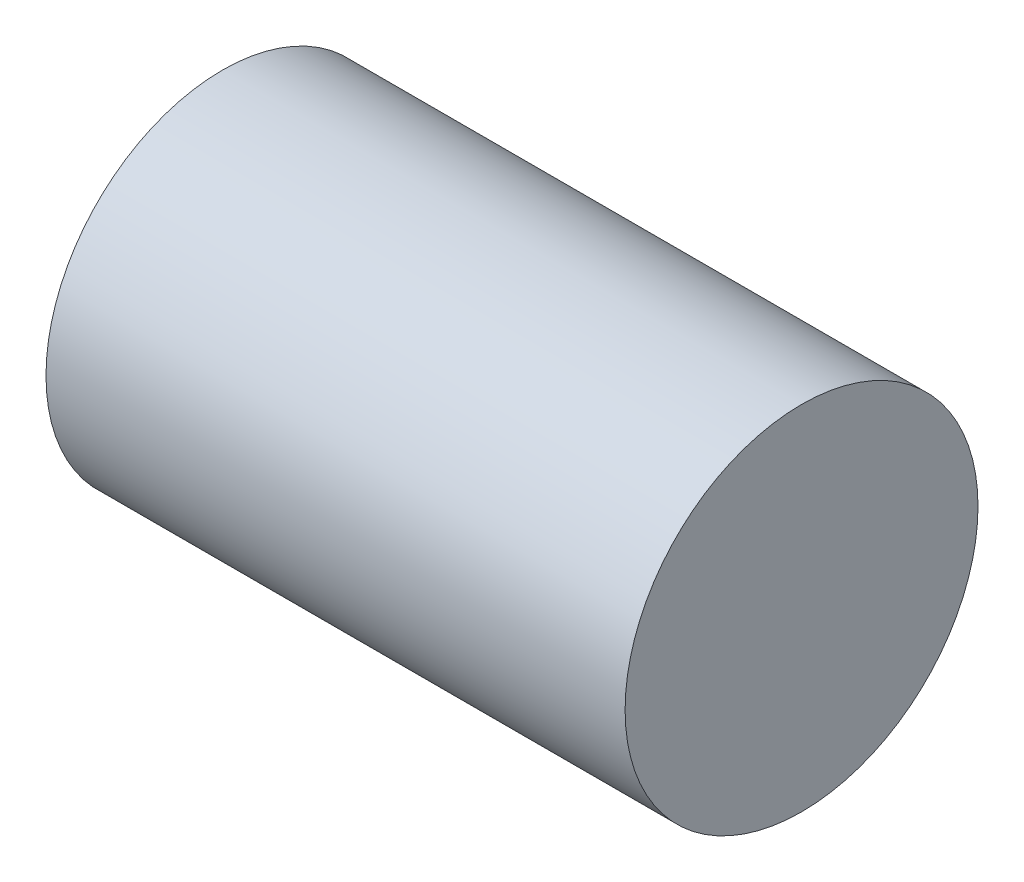
ISO-10303-21;
HEADER;
FILE_DESCRIPTION(('STEP AP214'),'2;1');
FILE_NAME('part.step','',(''),(''),'','','');
FILE_SCHEMA(('AUTOMOTIVE_DESIGN { 1 0 10303 214 1 1 1 1 }'));
ENDSEC;
DATA;
#1=APPLICATION_CONTEXT('core data for automotive mechanical design processes');
#2=APPLICATION_PROTOCOL_DEFINITION('international standard','automotive_design',2000,#1);
#3=PRODUCT_CONTEXT('',#1,'mechanical');
#4=PRODUCT('Part','Part','',(#3));
#5=PRODUCT_RELATED_PRODUCT_CATEGORY('part','',(#4));
#6=PRODUCT_DEFINITION_FORMATION('','',#4);
#7=PRODUCT_DEFINITION_CONTEXT('part definition',#1,'design');
#8=PRODUCT_DEFINITION('design','',#6,#7);
#9=PRODUCT_DEFINITION_SHAPE('','',#8);
#10=(LENGTH_UNIT() NAMED_UNIT(*) SI_UNIT(.MILLI.,.METRE.));
#11=(NAMED_UNIT(*) PLANE_ANGLE_UNIT() SI_UNIT($,.RADIAN.));
#12=(NAMED_UNIT(*) SI_UNIT($,.STERADIAN.) SOLID_ANGLE_UNIT());
#13=UNCERTAINTY_MEASURE_WITH_UNIT(LENGTH_MEASURE(1.E-05),#10,'distance_accuracy_value','');
#14=(GEOMETRIC_REPRESENTATION_CONTEXT(3) GLOBAL_UNCERTAINTY_ASSIGNED_CONTEXT((#13)) GLOBAL_UNIT_ASSIGNED_CONTEXT((#10,
#11,#12)) REPRESENTATION_CONTEXT('',''));
#15=CARTESIAN_POINT('',(0.,0.,0.));
#16=DIRECTION('',(0.,0.,1.));
#17=DIRECTION('',(1.,0.,0.));
#18=AXIS2_PLACEMENT_3D('',#15,#16,#17);
#19=CARTESIAN_POINT('',(64.,0.,0.));
#20=DIRECTION('',(-1.,0.,0.));
#21=DIRECTION('',(0.,0.,1.));
#22=AXIS2_PLACEMENT_3D('',#19,#20,#21);
#23=CYLINDRICAL_SURFACE('',#22,19.5);
#24=CARTESIAN_POINT('',(64.,0.,0.));
#25=DIRECTION('',(1.,0.,0.));
#26=DIRECTION('',(0.,0.,-1.));
#27=AXIS2_PLACEMENT_3D('',#24,#25,#26);
#28=CIRCLE('',#27,19.5);
#29=CARTESIAN_POINT('',(64.,0.,-19.5));
#30=VERTEX_POINT('',#29);
#31=EDGE_CURVE('E10',#30,#30,#28,.T.);
#32=ORIENTED_EDGE('',*,*,#31,.F.);
#33=EDGE_LOOP('',(#32));
#34=FACE_BOUND('',#33,.T.);
#35=CARTESIAN_POINT('',(0.,0.,0.));
#36=DIRECTION('',(1.,0.,0.));
#37=DIRECTION('',(0.,0.,-1.));
#38=AXIS2_PLACEMENT_3D('',#35,#36,#37);
#39=CIRCLE('',#38,19.5);
#40=CARTESIAN_POINT('',(0.,0.,-19.5));
#41=VERTEX_POINT('',#40);
#42=EDGE_CURVE('E34',#41,#41,#39,.T.);
#43=ORIENTED_EDGE('',*,*,#42,.T.);
#44=EDGE_LOOP('',(#43));
#45=FACE_BOUND('',#44,.T.);
#46=ADVANCED_FACE('F31',(#34,#45),#23,.T.);
#47=CARTESIAN_POINT('',(64.,0.,0.));
#48=DIRECTION('',(1.,0.,0.));
#49=DIRECTION('',(0.,0.,-1.));
#50=AXIS2_PLACEMENT_3D('',#47,#48,#49);
#51=PLANE('',#50);
#52=ORIENTED_EDGE('',*,*,#31,.T.);
#53=EDGE_LOOP('',(#52));
#54=FACE_BOUND('',#53,.T.);
#55=ADVANCED_FACE('F60',(#54),#51,.T.);
#56=CARTESIAN_POINT('',(0.,0.,0.));
#57=DIRECTION('',(1.,0.,0.));
#58=DIRECTION('',(0.,0.,-1.));
#59=AXIS2_PLACEMENT_3D('',#56,#57,#58);
#60=PLANE('',#59);
#61=CARTESIAN_POINT('',(0.,0.,0.));
#62=DIRECTION('',(-1.,0.,0.));
#63=DIRECTION('',(0.,0.,1.));
#64=AXIS2_PLACEMENT_3D('',#61,#62,#63);
#65=CIRCLE('',#64,8.);
#66=CARTESIAN_POINT('',(0.,0.,8.));
#67=VERTEX_POINT('',#66);
#68=EDGE_CURVE('E43',#67,#67,#65,.T.);
#69=ORIENTED_EDGE('',*,*,#68,.F.);
#70=EDGE_LOOP('',(#69));
#71=FACE_BOUND('',#70,.T.);
#72=ORIENTED_EDGE('',*,*,#42,.F.);
#73=EDGE_LOOP('',(#72));
#74=FACE_BOUND('',#73,.T.);
#75=ADVANCED_FACE('F54',(#71,#74),#60,.F.);
#76=CARTESIAN_POINT('',(50.,0.,0.));
#77=DIRECTION('',(-1.,0.,0.));
#78=DIRECTION('',(0.,0.,1.));
#79=AXIS2_PLACEMENT_3D('',#76,#77,#78);
#80=CYLINDRICAL_SURFACE('',#79,8.);
#81=CARTESIAN_POINT('',(50.,0.,0.));
#82=DIRECTION('',(-1.,0.,0.));
#83=DIRECTION('',(0.,0.,1.));
#84=AXIS2_PLACEMENT_3D('',#81,#82,#83);
#85=CIRCLE('',#84,8.);
#86=CARTESIAN_POINT('',(50.,0.,8.));
#87=VERTEX_POINT('',#86);
#88=EDGE_CURVE('E41',#87,#87,#85,.T.);
#89=ORIENTED_EDGE('',*,*,#88,.F.);
#90=EDGE_LOOP('',(#89));
#91=FACE_BOUND('',#90,.T.);
#92=ORIENTED_EDGE('',*,*,#68,.T.);
#93=EDGE_LOOP('',(#92));
#94=FACE_BOUND('',#93,.T.);
#95=ADVANCED_FACE('F51',(#91,#94),#80,.F.);
#96=CARTESIAN_POINT('',(50.,0.,0.));
#97=DIRECTION('',(-1.,0.,0.));
#98=DIRECTION('',(0.,0.,1.));
#99=AXIS2_PLACEMENT_3D('',#96,#97,#98);
#100=PLANE('',#99);
#101=ORIENTED_EDGE('',*,*,#88,.T.);
#102=EDGE_LOOP('',(#101));
#103=FACE_BOUND('',#102,.T.);
#104=ADVANCED_FACE('F49',(#103),#100,.T.);
#105=CLOSED_SHELL('',(#46,#55,#75,#95,#104));
#106=MANIFOLD_SOLID_BREP('B2',#105);
#107=ADVANCED_BREP_SHAPE_REPRESENTATION('',(#18,#106),#14);
#108=SHAPE_DEFINITION_REPRESENTATION(#9,#107);
ENDSEC;
END-ISO-10303-21;
